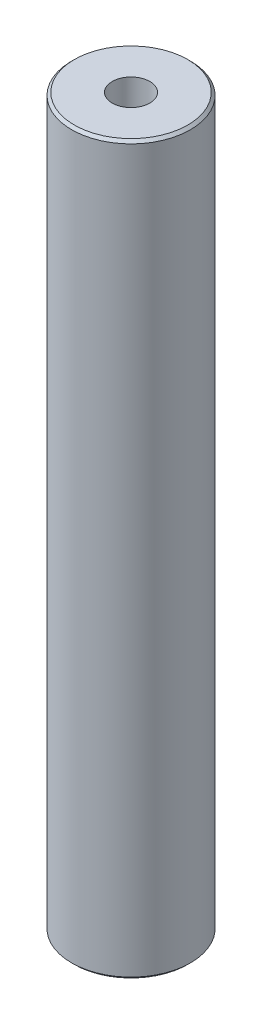
ISO-10303-21;
HEADER;
FILE_DESCRIPTION(('STEP AP214'),'2;1');
FILE_NAME('part.step','',(''),(''),'','','');
FILE_SCHEMA(('AUTOMOTIVE_DESIGN { 1 0 10303 214 1 1 1 1 }'));
ENDSEC;
DATA;
#1=APPLICATION_CONTEXT('core data for automotive mechanical design processes');
#2=APPLICATION_PROTOCOL_DEFINITION('international standard','automotive_design',2000,#1);
#3=PRODUCT_CONTEXT('',#1,'mechanical');
#4=PRODUCT('Part','Part','',(#3));
#5=PRODUCT_RELATED_PRODUCT_CATEGORY('part','',(#4));
#6=PRODUCT_DEFINITION_FORMATION('','',#4);
#7=PRODUCT_DEFINITION_CONTEXT('part definition',#1,'design');
#8=PRODUCT_DEFINITION('design','',#6,#7);
#9=PRODUCT_DEFINITION_SHAPE('','',#8);
#10=(LENGTH_UNIT() NAMED_UNIT(*) SI_UNIT(.MILLI.,.METRE.));
#11=(NAMED_UNIT(*) PLANE_ANGLE_UNIT() SI_UNIT($,.RADIAN.));
#12=(NAMED_UNIT(*) SI_UNIT($,.STERADIAN.) SOLID_ANGLE_UNIT());
#13=UNCERTAINTY_MEASURE_WITH_UNIT(LENGTH_MEASURE(1.E-05),#10,'distance_accuracy_value','');
#14=(GEOMETRIC_REPRESENTATION_CONTEXT(3) GLOBAL_UNCERTAINTY_ASSIGNED_CONTEXT((#13)) GLOBAL_UNIT_ASSIGNED_CONTEXT((#10,
#11,#12)) REPRESENTATION_CONTEXT('',''));
#15=CARTESIAN_POINT('',(0.,0.,0.));
#16=DIRECTION('',(0.,0.,1.));
#17=DIRECTION('',(1.,0.,0.));
#18=AXIS2_PLACEMENT_3D('',#15,#16,#17);
#19=CARTESIAN_POINT('',(0.,244.581951853061,0.));
#20=DIRECTION('',(0.,-1.,0.));
#21=DIRECTION('',(0.,0.,-1.));
#22=AXIS2_PLACEMENT_3D('',#19,#20,#21);
#23=CYLINDRICAL_SURFACE('',#22,20.);
#24=CARTESIAN_POINT('',(0.,243.674882787719,0.));
#25=DIRECTION('',(0.,1.,0.));
#26=DIRECTION('',(0.,0.,1.));
#27=AXIS2_PLACEMENT_3D('',#24,#25,#26);
#28=CIRCLE('',#27,20.);
#29=CARTESIAN_POINT('',(0.,243.674882787719,-20.));
#30=VERTEX_POINT('',#29);
#31=EDGE_CURVE('E50',#30,#30,#28,.F.);
#32=CARTESIAN_POINT('',(0.,0.907069065342297,0.));
#33=DIRECTION('',(0.,1.,0.));
#34=DIRECTION('',(0.,0.,1.));
#35=AXIS2_PLACEMENT_3D('',#32,#33,#34);
#36=CIRCLE('',#35,20.);
#37=CARTESIAN_POINT('',(0.,0.90706906534227,-20.));
#38=VERTEX_POINT('',#37);
#39=EDGE_CURVE('E51',#38,#38,#36,.T.);
#40=CARTESIAN_POINT('',(0.,243.674882787719,-20.));
#41=CARTESIAN_POINT('',(0.,241.146051394777,-20.));
#42=CARTESIAN_POINT('',(0.,238.617220001836,-20.));
#43=CARTESIAN_POINT('',(0.,233.559557215953,-20.));
#44=CARTESIAN_POINT('',(0.,231.030725823011,-20.));
#45=CARTESIAN_POINT('',(0.,225.973063037129,-20.));
#46=CARTESIAN_POINT('',(0.,223.444231644187,-20.));
#47=CARTESIAN_POINT('',(0.,218.386568858304,-20.));
#48=CARTESIAN_POINT('',(0.,215.857737465363,-20.));
#49=CARTESIAN_POINT('',(0.,210.80007467948,-20.));
#50=CARTESIAN_POINT('',(0.,208.271243286539,-20.));
#51=CARTESIAN_POINT('',(0.,203.213580500656,-20.));
#52=CARTESIAN_POINT('',(0.,200.684749107714,-20.));
#53=CARTESIAN_POINT('',(0.,195.627086321832,-20.));
#54=CARTESIAN_POINT('',(0.,193.09825492889,-20.));
#55=CARTESIAN_POINT('',(0.,188.040592143007,-20.));
#56=CARTESIAN_POINT('',(0.,185.511760750066,-20.));
#57=CARTESIAN_POINT('',(0.,180.454097964183,-20.));
#58=CARTESIAN_POINT('',(0.,177.925266571242,-20.));
#59=CARTESIAN_POINT('',(0.,172.867603785359,-20.));
#60=CARTESIAN_POINT('',(0.,170.338772392417,-20.));
#61=CARTESIAN_POINT('',(0.,165.281109606535,-20.));
#62=CARTESIAN_POINT('',(0.,162.752278213593,-20.));
#63=CARTESIAN_POINT('',(0.,157.69461542771,-20.));
#64=CARTESIAN_POINT('',(0.,155.165784034769,-20.));
#65=CARTESIAN_POINT('',(0.,150.108121248886,-20.));
#66=CARTESIAN_POINT('',(0.,147.579289855945,-20.));
#67=CARTESIAN_POINT('',(0.,142.521627070062,-20.));
#68=CARTESIAN_POINT('',(0.,139.99279567712,-20.));
#69=CARTESIAN_POINT('',(0.,134.935132891238,-20.));
#70=CARTESIAN_POINT('',(0.,132.406301498296,-20.));
#71=CARTESIAN_POINT('',(0.,127.348638712413,-20.));
#72=CARTESIAN_POINT('',(0.,124.819807319472,-20.));
#73=CARTESIAN_POINT('',(0.,119.762144533589,-20.));
#74=CARTESIAN_POINT('',(0.,117.233313140648,-20.));
#75=CARTESIAN_POINT('',(0.,112.175650354765,-20.));
#76=CARTESIAN_POINT('',(0.,109.646818961823,-20.));
#77=CARTESIAN_POINT('',(0.,104.58915617594,-20.));
#78=CARTESIAN_POINT('',(0.,102.060324782999,-20.));
#79=CARTESIAN_POINT('',(0.,97.0026619971162,-20.));
#80=CARTESIAN_POINT('',(0.,94.4738306041748,-20.));
#81=CARTESIAN_POINT('',(0.,89.416167818292,-20.));
#82=CARTESIAN_POINT('',(0.,86.8873364253506,-20.));
#83=CARTESIAN_POINT('',(0.,81.8296736394677,-20.));
#84=CARTESIAN_POINT('',(0.,79.3008422465263,-20.));
#85=CARTESIAN_POINT('',(0.,74.2431794606434,-20.));
#86=CARTESIAN_POINT('',(0.,71.714348067702,-20.));
#87=CARTESIAN_POINT('',(0.,66.6566852818192,-20.));
#88=CARTESIAN_POINT('',(0.,64.1278538888778,-20.));
#89=CARTESIAN_POINT('',(0.,59.0701911029949,-20.));
#90=CARTESIAN_POINT('',(0.,56.5413597100535,-20.));
#91=CARTESIAN_POINT('',(0.,51.4836969241707,-20.));
#92=CARTESIAN_POINT('',(0.,48.9548655312292,-20.));
#93=CARTESIAN_POINT('',(0.,43.8972027453464,-20.));
#94=CARTESIAN_POINT('',(0.,41.368371352405,-20.));
#95=CARTESIAN_POINT('',(0.,36.3107085665222,-20.));
#96=CARTESIAN_POINT('',(0.,33.7818771735807,-20.));
#97=CARTESIAN_POINT('',(0.,28.7242143876979,-20.));
#98=CARTESIAN_POINT('',(0.,26.1953829947565,-20.));
#99=CARTESIAN_POINT('',(0.,21.1377202088736,-20.));
#100=CARTESIAN_POINT('',(0.,18.6088888159322,-20.));
#101=CARTESIAN_POINT('',(0.,13.5512260300494,-20.));
#102=CARTESIAN_POINT('',(0.,11.0223946371079,-20.));
#103=CARTESIAN_POINT('',(0.,5.96473185122511,-20.));
#104=CARTESIAN_POINT('',(0.,3.43590045828369,-20.));
#105=CARTESIAN_POINT('',(0.,0.90706906534227,-20.));
#106=B_SPLINE_CURVE_WITH_KNOTS('',3,(#40,#41,#42,#43,#44,#45,#46,#47,#48,#49,#50,#51,#52,#53,
#54,#55,#56,#57,#58,#59,#60,#61,#62,#63,#64,#65,#66,#67,#68,#69,#70,#71,#72,#73,#74,#75,#76,#77,
#78,#79,#80,#81,#82,#83,#84,#85,#86,#87,#88,#89,#90,#91,#92,#93,#94,#95,#96,#97,#98,#99,#100,
#101,#102,#103,#104,#105),.UNSPECIFIED.,.F.,.F.,(4,2,2,2,2,2,2,2,2,2,2,2,2,2,2,2,2,2,2,2,2,2,2,
2,2,2,2,2,2,2,2,2,4),(0.,7.58649417882423,15.1729883576485,22.7594825364728,30.345976715297,
37.9324708941213,45.5189650729455,53.1054592517698,60.6919534305941,68.2784476094183,
75.8649417882426,83.4514359670668,91.0379301458911,98.6244243247153,106.21091850354,
113.797412682364,121.383906861188,128.970401040012,136.556895218837,144.143389397661,
151.729883576485,159.316377755309,166.902871934134,174.489366112958,182.075860291782,
189.662354470606,197.248848649431,204.835342828255,212.421837007079,220.008331185904,
227.594825364728,235.181319543552,242.767813722376),.UNSPECIFIED.);
#107=EDGE_CURVE('BSEAM39',#30,#38,#106,.T.);
#108=ORIENTED_EDGE('',*,*,#31,.T.);
#109=ORIENTED_EDGE('',*,*,#39,.T.);
#110=ORIENTED_EDGE('',*,*,#107,.T.);
#111=ORIENTED_EDGE('',*,*,#107,.F.);
#112=EDGE_LOOP('',(#108,#110,#109,#111));
#113=FACE_BOUND('',#112,.T.);
#114=ADVANCED_FACE('F39',(#113),#23,.T.);
#115=CARTESIAN_POINT('',(0.,244.581951853061,0.));
#116=DIRECTION('',(0.,1.,0.));
#117=DIRECTION('',(0.,0.,1.));
#118=AXIS2_PLACEMENT_3D('',#115,#116,#117);
#119=PLANE('',#118);
#120=CARTESIAN_POINT('',(0.,244.581951853061,0.));
#121=DIRECTION('',(0.,1.,0.));
#122=DIRECTION('',(0.,0.,1.));
#123=AXIS2_PLACEMENT_3D('',#120,#121,#122);
#124=CIRCLE('',#123,19.092930934658);
#125=CARTESIAN_POINT('',(0.,244.581951853061,-19.092930934658));
#126=VERTEX_POINT('',#125);
#127=EDGE_CURVE('E54',#126,#126,#124,.T.);
#128=ORIENTED_EDGE('',*,*,#127,.T.);
#129=EDGE_LOOP('',(#128));
#130=FACE_BOUND('',#129,.T.);
#131=CARTESIAN_POINT('',(0.,244.581951853061,0.));
#132=DIRECTION('',(0.,1.,0.));
#133=DIRECTION('',(0.,0.,1.));
#134=AXIS2_PLACEMENT_3D('',#131,#132,#133);
#135=CIRCLE('',#134,6.31523281718971);
#136=CARTESIAN_POINT('',(0.,244.581951853061,-6.31523281718971));
#137=VERTEX_POINT('',#136);
#138=EDGE_CURVE('E58',#137,#137,#135,.T.);
#139=ORIENTED_EDGE('',*,*,#138,.F.);
#140=EDGE_LOOP('',(#139));
#141=FACE_BOUND('',#140,.T.);
#142=ADVANCED_FACE('F69',(#130,#141),#119,.T.);
#143=CARTESIAN_POINT('',(0.,0.,0.));
#144=DIRECTION('',(0.,1.,0.));
#145=DIRECTION('',(0.,0.,1.));
#146=AXIS2_PLACEMENT_3D('',#143,#144,#145);
#147=PLANE('',#146);
#148=CARTESIAN_POINT('',(0.,0.,0.));
#149=DIRECTION('',(0.,1.,0.));
#150=DIRECTION('',(0.,0.,1.));
#151=AXIS2_PLACEMENT_3D('',#148,#149,#150);
#152=CIRCLE('',#151,19.0929309346577);
#153=CARTESIAN_POINT('',(0.,0.,19.0929309346577));
#154=VERTEX_POINT('',#153);
#155=EDGE_CURVE('E10',#154,#154,#152,.F.);
#156=ORIENTED_EDGE('',*,*,#155,.T.);
#157=EDGE_LOOP('',(#156));
#158=FACE_BOUND('',#157,.T.);
#159=CARTESIAN_POINT('',(0.,0.,0.));
#160=DIRECTION('',(0.,1.,0.));
#161=DIRECTION('',(0.,0.,1.));
#162=AXIS2_PLACEMENT_3D('',#159,#160,#161);
#163=CIRCLE('',#162,6.31523281718971);
#164=CARTESIAN_POINT('',(0.,0.,-6.31523281718971));
#165=VERTEX_POINT('',#164);
#166=EDGE_CURVE('E63',#165,#165,#163,.T.);
#167=ORIENTED_EDGE('',*,*,#166,.T.);
#168=EDGE_LOOP('',(#167));
#169=FACE_BOUND('',#168,.T.);
#170=ADVANCED_FACE('F75',(#158,#169),#147,.F.);
#171=CARTESIAN_POINT('',(0.,244.581951853061,0.));
#172=DIRECTION('',(0.,-1.,0.));
#173=DIRECTION('',(0.,0.,-1.));
#174=AXIS2_PLACEMENT_3D('',#171,#172,#173);
#175=CYLINDRICAL_SURFACE('',#174,6.31523281718971);
#176=CARTESIAN_POINT('',(0.,244.581951853061,-6.31523281718971));
#177=CARTESIAN_POINT('',(0.,242.034223187925,-6.31523281718971));
#178=CARTESIAN_POINT('',(0.,239.486494522788,-6.31523281718971));
#179=CARTESIAN_POINT('',(0.,234.391037192516,-6.31523281718971));
#180=CARTESIAN_POINT('',(0.,231.84330852738,-6.31523281718971));
#181=CARTESIAN_POINT('',(0.,226.747851197108,-6.31523281718971));
#182=CARTESIAN_POINT('',(0.,224.200122531972,-6.31523281718971));
#183=CARTESIAN_POINT('',(0.,219.1046652017,-6.31523281718971));
#184=CARTESIAN_POINT('',(0.,216.556936536564,-6.31523281718971));
#185=CARTESIAN_POINT('',(0.,211.461479206292,-6.31523281718971));
#186=CARTESIAN_POINT('',(0.,208.913750541156,-6.31523281718971));
#187=CARTESIAN_POINT('',(0.,203.818293210884,-6.31523281718971));
#188=CARTESIAN_POINT('',(0.,201.270564545748,-6.31523281718971));
#189=CARTESIAN_POINT('',(0.,196.175107215476,-6.31523281718971));
#190=CARTESIAN_POINT('',(0.,193.62737855034,-6.31523281718971));
#191=CARTESIAN_POINT('',(0.,188.531921220068,-6.31523281718971));
#192=CARTESIAN_POINT('',(0.,185.984192554931,-6.31523281718971));
#193=CARTESIAN_POINT('',(0.,180.888735224659,-6.31523281718971));
#194=CARTESIAN_POINT('',(0.,178.341006559523,-6.31523281718971));
#195=CARTESIAN_POINT('',(0.,173.245549229251,-6.31523281718971));
#196=CARTESIAN_POINT('',(0.,170.697820564115,-6.31523281718971));
#197=CARTESIAN_POINT('',(0.,165.602363233843,-6.31523281718971));
#198=CARTESIAN_POINT('',(0.,163.054634568707,-6.31523281718971));
#199=CARTESIAN_POINT('',(0.,157.959177238435,-6.31523281718971));
#200=CARTESIAN_POINT('',(0.,155.411448573299,-6.31523281718971));
#201=CARTESIAN_POINT('',(0.,150.315991243027,-6.31523281718971));
#202=CARTESIAN_POINT('',(0.,147.768262577891,-6.31523281718971));
#203=CARTESIAN_POINT('',(0.,142.672805247619,-6.31523281718971));
#204=CARTESIAN_POINT('',(0.,140.125076582483,-6.31523281718971));
#205=CARTESIAN_POINT('',(0.,135.029619252211,-6.31523281718971));
#206=CARTESIAN_POINT('',(0.,132.481890587075,-6.31523281718971));
#207=CARTESIAN_POINT('',(0.,127.386433256802,-6.31523281718971));
#208=CARTESIAN_POINT('',(0.,124.838704591666,-6.31523281718971));
#209=CARTESIAN_POINT('',(0.,119.743247261394,-6.31523281718971));
#210=CARTESIAN_POINT('',(0.,117.195518596258,-6.31523281718971));
#211=CARTESIAN_POINT('',(0.,112.100061265986,-6.31523281718971));
#212=CARTESIAN_POINT('',(0.,109.55233260085,-6.31523281718971));
#213=CARTESIAN_POINT('',(0.,104.456875270578,-6.31523281718971));
#214=CARTESIAN_POINT('',(0.,101.909146605442,-6.31523281718971));
#215=CARTESIAN_POINT('',(0.,96.8136892751698,-6.31523281718971));
#216=CARTESIAN_POINT('',(0.,94.2659606100338,-6.31523281718971));
#217=CARTESIAN_POINT('',(0.,89.1705032797617,-6.31523281718971));
#218=CARTESIAN_POINT('',(0.,86.6227746146256,-6.31523281718971));
#219=CARTESIAN_POINT('',(0.,81.5273172843535,-6.31523281718971));
#220=CARTESIAN_POINT('',(0.,78.9795886192175,-6.31523281718971));
#221=CARTESIAN_POINT('',(0.,73.8841312889454,-6.31523281718971));
#222=CARTESIAN_POINT('',(0.,71.3364026238093,-6.31523281718971));
#223=CARTESIAN_POINT('',(0.,66.2409452935373,-6.31523281718971));
#224=CARTESIAN_POINT('',(0.,63.6932166284012,-6.31523281718971));
#225=CARTESIAN_POINT('',(0.,58.5977592981291,-6.31523281718971));
#226=CARTESIAN_POINT('',(0.,56.0500306329931,-6.31523281718971));
#227=CARTESIAN_POINT('',(0.,50.954573302721,-6.31523281718971));
#228=CARTESIAN_POINT('',(0.,48.4068446375849,-6.31523281718971));
#229=CARTESIAN_POINT('',(0.,43.3113873073128,-6.31523281718971));
#230=CARTESIAN_POINT('',(0.,40.7636586421768,-6.31523281718971));
#231=CARTESIAN_POINT('',(0.,35.6682013119047,-6.31523281718971));
#232=CARTESIAN_POINT('',(0.,33.1204726467686,-6.31523281718971));
#233=CARTESIAN_POINT('',(0.,28.0250153164965,-6.31523281718971));
#234=CARTESIAN_POINT('',(0.,25.4772866513605,-6.31523281718971));
#235=CARTESIAN_POINT('',(0.,20.3818293210884,-6.31523281718971));
#236=CARTESIAN_POINT('',(0.,17.8341006559523,-6.31523281718971));
#237=CARTESIAN_POINT('',(0.,12.7386433256802,-6.31523281718971));
#238=CARTESIAN_POINT('',(0.,10.1909146605442,-6.31523281718971));
#239=CARTESIAN_POINT('',(0.,5.09545733027209,-6.31523281718971));
#240=CARTESIAN_POINT('',(0.,2.54772866513605,-6.31523281718971));
#241=CARTESIAN_POINT('',(0.,0.,-6.31523281718971));
#242=B_SPLINE_CURVE_WITH_KNOTS('',3,(#176,#177,#178,#179,#180,#181,#182,#183,#184,#185,#186,
#187,#188,#189,#190,#191,#192,#193,#194,#195,#196,#197,#198,#199,#200,#201,#202,#203,#204,#205,
#206,#207,#208,#209,#210,#211,#212,#213,#214,#215,#216,#217,#218,#219,#220,#221,#222,#223,#224,
#225,#226,#227,#228,#229,#230,#231,#232,#233,#234,#235,#236,#237,#238,#239,#240,#241),
.UNSPECIFIED.,.F.,.F.,(4,2,2,2,2,2,2,2,2,2,2,2,2,2,2,2,2,2,2,2,2,2,2,2,2,2,2,2,2,2,2,2,4),(0.,
7.64318599540814,15.2863719908163,22.9295579862244,30.5727439816326,38.2159299770407,
45.8591159724488,53.502301967857,61.1454879632651,68.7886739586733,76.4318599540814,
84.0750459494896,91.7182319448977,99.3614179403058,107.004603935714,114.647789931122,
122.29097592653,129.934161921938,137.577347917347,145.220533912755,152.863719908163,
160.506905903571,168.150091898979,175.793277894387,183.436463889795,191.079649885204,
198.722835880612,206.36602187602,214.009207871428,221.652393866836,229.295579862244,
236.938765857652,244.581951853061),.UNSPECIFIED.);
#243=EDGE_CURVE('BSEAM70',#137,#165,#242,.T.);
#244=ORIENTED_EDGE('',*,*,#138,.T.);
#245=ORIENTED_EDGE('',*,*,#166,.F.);
#246=ORIENTED_EDGE('',*,*,#243,.T.);
#247=ORIENTED_EDGE('',*,*,#243,.F.);
#248=EDGE_LOOP('',(#244,#246,#245,#247));
#249=FACE_BOUND('',#248,.T.);
#250=ADVANCED_FACE('F70',(#249),#175,.F.);
#251=CARTESIAN_POINT('',(0.,244.581951853061,0.));
#252=DIRECTION('',(0.,-1.,0.));
#253=DIRECTION('',(0.,0.,-1.));
#254=AXIS2_PLACEMENT_3D('',#251,#252,#253);
#255=CONICAL_SURFACE('',#254,19.092930934658,0.785398163397441);
#256=CARTESIAN_POINT('',(0.,243.674882787719,-20.));
#257=CARTESIAN_POINT('',(0.,243.684331423816,-19.9905513639027));
#258=CARTESIAN_POINT('',(0.,243.693780059913,-19.9811027278054));
#259=CARTESIAN_POINT('',(0.,243.712677332108,-19.9622054556108));
#260=CARTESIAN_POINT('',(0.,243.722125968205,-19.9527568195134));
#261=CARTESIAN_POINT('',(0.,243.7410232404,-19.9338595473188));
#262=CARTESIAN_POINT('',(0.,243.750471876497,-19.9244109112215));
#263=CARTESIAN_POINT('',(0.,243.769369148692,-19.9055136390269));
#264=CARTESIAN_POINT('',(0.,243.778817784789,-19.8960650029296));
#265=CARTESIAN_POINT('',(0.,243.797715056984,-19.8771677307349));
#266=CARTESIAN_POINT('',(0.,243.807163693081,-19.8677190946376));
#267=CARTESIAN_POINT('',(0.,243.826060965276,-19.848821822443));
#268=CARTESIAN_POINT('',(0.,243.835509601373,-19.8393731863457));
#269=CARTESIAN_POINT('',(0.,243.854406873568,-19.8204759141511));
#270=CARTESIAN_POINT('',(0.,243.863855509665,-19.8110272780538));
#271=CARTESIAN_POINT('',(0.,243.882752781859,-19.7921300058591));
#272=CARTESIAN_POINT('',(0.,243.892201417957,-19.7826813697618));
#273=CARTESIAN_POINT('',(0.,243.911098690151,-19.7637840975672));
#274=CARTESIAN_POINT('',(0.,243.920547326249,-19.7543354614699));
#275=CARTESIAN_POINT('',(0.,243.939444598443,-19.7354381892753));
#276=CARTESIAN_POINT('',(0.,243.948893234541,-19.7259895531779));
#277=CARTESIAN_POINT('',(0.,243.967790506735,-19.7070922809833));
#278=CARTESIAN_POINT('',(0.,243.977239142833,-19.697643644886));
#279=CARTESIAN_POINT('',(0.,243.996136415027,-19.6787463726914));
#280=CARTESIAN_POINT('',(0.,244.005585051125,-19.6692977365941));
#281=CARTESIAN_POINT('',(0.,244.024482323319,-19.6504004643994));
#282=CARTESIAN_POINT('',(0.,244.033930959416,-19.6409518283021));
#283=CARTESIAN_POINT('',(0.,244.052828231611,-19.6220545561075));
#284=CARTESIAN_POINT('',(0.,244.062276867708,-19.6126059200102));
#285=CARTESIAN_POINT('',(0.,244.081174139903,-19.5937086478156));
#286=CARTESIAN_POINT('',(0.,244.090622776,-19.5842600117183));
#287=CARTESIAN_POINT('',(0.,244.109520048195,-19.5653627395236));
#288=CARTESIAN_POINT('',(0.,244.118968684292,-19.5559141034263));
#289=CARTESIAN_POINT('',(0.,244.137865956487,-19.5370168312317));
#290=CARTESIAN_POINT('',(0.,244.147314592584,-19.5275681951344));
#291=CARTESIAN_POINT('',(0.,244.166211864779,-19.5086709229398));
#292=CARTESIAN_POINT('',(0.,244.175660500876,-19.4992222868425));
#293=CARTESIAN_POINT('',(0.,244.194557773071,-19.4803250146478));
#294=CARTESIAN_POINT('',(0.,244.204006409168,-19.4708763785505));
#295=CARTESIAN_POINT('',(0.,244.222903681363,-19.4519791063559));
#296=CARTESIAN_POINT('',(0.,244.23235231746,-19.4425304702586));
#297=CARTESIAN_POINT('',(0.,244.251249589655,-19.423633198064));
#298=CARTESIAN_POINT('',(0.,244.260698225752,-19.4141845619666));
#299=CARTESIAN_POINT('',(0.,244.279595497947,-19.395287289772));
#300=CARTESIAN_POINT('',(0.,244.289044134044,-19.3858386536747));
#301=CARTESIAN_POINT('',(0.,244.307941406239,-19.3669413814801));
#302=CARTESIAN_POINT('',(0.,244.317390042336,-19.3574927453828));
#303=CARTESIAN_POINT('',(0.,244.33628731453,-19.3385954731881));
#304=CARTESIAN_POINT('',(0.,244.345735950628,-19.3291468370908));
#305=CARTESIAN_POINT('',(0.,244.364633222822,-19.3102495648962));
#306=CARTESIAN_POINT('',(0.,244.37408185892,-19.3008009287989));
#307=CARTESIAN_POINT('',(0.,244.392979131114,-19.2819036566043));
#308=CARTESIAN_POINT('',(0.,244.402427767212,-19.2724550205069));
#309=CARTESIAN_POINT('',(0.,244.421325039406,-19.2535577483123));
#310=CARTESIAN_POINT('',(0.,244.430773675504,-19.244109112215));
#311=CARTESIAN_POINT('',(0.,244.449670947698,-19.2252118400204));
#312=CARTESIAN_POINT('',(0.,244.459119583796,-19.2157632039231));
#313=CARTESIAN_POINT('',(0.,244.47801685599,-19.1968659317284));
#314=CARTESIAN_POINT('',(0.,244.487465492087,-19.1874172956311));
#315=CARTESIAN_POINT('',(0.,244.506362764282,-19.1685200234365));
#316=CARTESIAN_POINT('',(0.,244.515811400379,-19.1590713873392));
#317=CARTESIAN_POINT('',(0.,244.534708672574,-19.1401741151446));
#318=CARTESIAN_POINT('',(0.,244.544157308671,-19.1307254790473));
#319=CARTESIAN_POINT('',(0.,244.563054580866,-19.1118282068526));
#320=CARTESIAN_POINT('',(0.,244.572503216963,-19.1023795707553));
#321=CARTESIAN_POINT('',(0.,244.581951853061,-19.092930934658));
#322=B_SPLINE_CURVE_WITH_KNOTS('',3,(#256,#257,#258,#259,#260,#261,#262,#263,#264,#265,#266,
#267,#268,#269,#270,#271,#272,#273,#274,#275,#276,#277,#278,#279,#280,#281,#282,#283,#284,#285,
#286,#287,#288,#289,#290,#291,#292,#293,#294,#295,#296,#297,#298,#299,#300,#301,#302,#303,#304,
#305,#306,#307,#308,#309,#310,#311,#312,#313,#314,#315,#316,#317,#318,#319,#320,#321),
.UNSPECIFIED.,.F.,.F.,(4,2,2,2,2,2,2,2,2,2,2,2,2,2,2,2,2,2,2,2,2,2,2,2,2,2,2,2,2,2,2,2,4),(0.,
0.0400871679442539,0.0801743358884882,0.120261503832742,0.160348671776976,0.200435839721233,
0.240523007665467,0.280610175609701,0.320697343553955,0.360784511498189,0.400871679442443,
0.440958847386678,0.481046015330912,0.521133183275168,0.561220351219403,0.601307519163657,
0.641394687107891,0.681481855052125,0.721569022996379,0.761656190940613,0.801743358884867,
0.841830526829104,0.881917694773338,0.922004862717592,0.962092030661827,1.00217919860608,
1.04226636655031,1.08235353449455,1.12244070243881,1.16252787038304,1.20261503832729,
1.24270220627153,1.28278937421578),.UNSPECIFIED.);
#323=EDGE_CURVE('BSEAM81',#30,#126,#322,.T.);
#324=ORIENTED_EDGE('',*,*,#31,.F.);
#325=ORIENTED_EDGE('',*,*,#127,.F.);
#326=ORIENTED_EDGE('',*,*,#323,.T.);
#327=ORIENTED_EDGE('',*,*,#323,.F.);
#328=EDGE_LOOP('',(#324,#326,#325,#327));
#329=FACE_BOUND('',#328,.T.);
#330=ADVANCED_FACE('F81',(#329),#255,.T.);
#331=CARTESIAN_POINT('',(0.,0.907069065342297,0.));
#332=DIRECTION('',(0.,1.,0.));
#333=DIRECTION('',(0.,0.,1.));
#334=AXIS2_PLACEMENT_3D('',#331,#332,#333);
#335=CONICAL_SURFACE('',#334,20.,0.785398163397471);
#336=ORIENTED_EDGE('',*,*,#155,.F.);
#337=EDGE_LOOP('',(#336));
#338=FACE_BOUND('',#337,.T.);
#339=ORIENTED_EDGE('',*,*,#39,.F.);
#340=EDGE_LOOP('',(#339));
#341=FACE_BOUND('',#340,.T.);
#342=ADVANCED_FACE('F45',(#338,#341),#335,.T.);
#343=CLOSED_SHELL('',(#114,#142,#170,#250,#330,#342));
#344=MANIFOLD_SOLID_BREP('B2',#343);
#345=ADVANCED_BREP_SHAPE_REPRESENTATION('',(#18,#344),#14);
#346=SHAPE_DEFINITION_REPRESENTATION(#9,#345);
ENDSEC;
END-ISO-10303-21;
